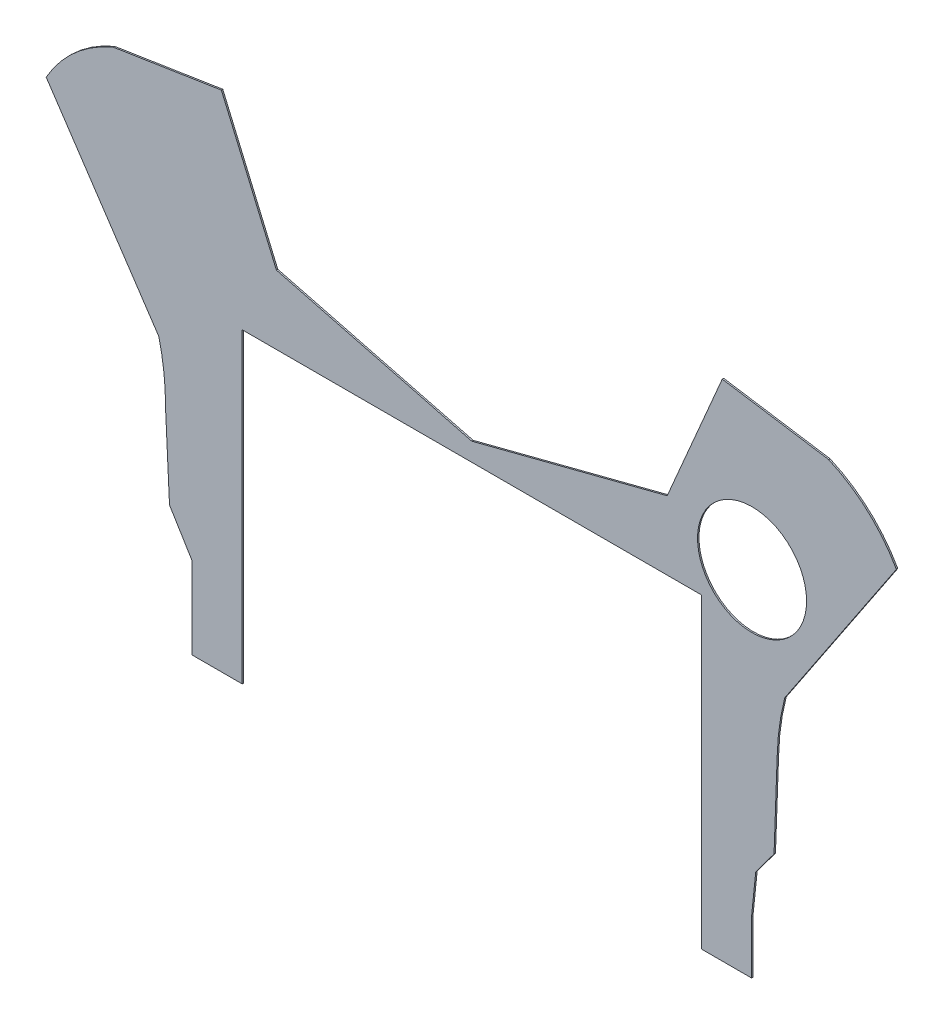
ISO-10303-21;
HEADER;
FILE_DESCRIPTION(('STEP AP214'),'2;1');
FILE_NAME('part.step','',(''),(''),'','','');
FILE_SCHEMA(('AUTOMOTIVE_DESIGN { 1 0 10303 214 1 1 1 1 }'));
ENDSEC;
DATA;
#1=APPLICATION_CONTEXT('core data for automotive mechanical design processes');
#2=APPLICATION_PROTOCOL_DEFINITION('international standard','automotive_design',2000,#1);
#3=PRODUCT_CONTEXT('',#1,'mechanical');
#4=PRODUCT('Part','Part','',(#3));
#5=PRODUCT_RELATED_PRODUCT_CATEGORY('part','',(#4));
#6=PRODUCT_DEFINITION_FORMATION('','',#4);
#7=PRODUCT_DEFINITION_CONTEXT('part definition',#1,'design');
#8=PRODUCT_DEFINITION('design','',#6,#7);
#9=PRODUCT_DEFINITION_SHAPE('','',#8);
#10=(LENGTH_UNIT() NAMED_UNIT(*) SI_UNIT(.MILLI.,.METRE.));
#11=(NAMED_UNIT(*) PLANE_ANGLE_UNIT() SI_UNIT($,.RADIAN.));
#12=(NAMED_UNIT(*) SI_UNIT($,.STERADIAN.) SOLID_ANGLE_UNIT());
#13=UNCERTAINTY_MEASURE_WITH_UNIT(LENGTH_MEASURE(1.E-05),#10,'distance_accuracy_value','');
#14=(GEOMETRIC_REPRESENTATION_CONTEXT(3) GLOBAL_UNCERTAINTY_ASSIGNED_CONTEXT((#13)) GLOBAL_UNIT_ASSIGNED_CONTEXT((#10,
#11,#12)) REPRESENTATION_CONTEXT('',''));
#15=CARTESIAN_POINT('',(0.,0.,0.));
#16=DIRECTION('',(0.,0.,1.));
#17=DIRECTION('',(1.,0.,0.));
#18=AXIS2_PLACEMENT_3D('',#15,#16,#17);
#19=CARTESIAN_POINT('',(72.2138054374449,15.665602419044,0.1));
#20=DIRECTION('',(0.,0.,1.));
#21=DIRECTION('',(1.,0.,0.));
#22=AXIS2_PLACEMENT_3D('',#19,#20,#21);
#23=PLANE('',#22);
#24=CARTESIAN_POINT('',(72.2138054374449,15.665602419044,0.1));
#25=DIRECTION('',(0.,0.,-1.));
#26=DIRECTION('',(1.,0.,0.));
#27=AXIS2_PLACEMENT_3D('',#24,#25,#26);
#28=CIRCLE('',#27,16.6592728359351);
#29=CARTESIAN_POINT('',(55.5594235199951,16.069253716389,0.1));
#30=VERTEX_POINT('',#29);
#31=CARTESIAN_POINT('',(56.0885640690144,19.8498541122362,0.1));
#32=VERTEX_POINT('',#31);
#33=EDGE_CURVE('E276',#30,#32,#28,.T.);
#34=ORIENTED_EDGE('',*,*,#33,.T.);
#35=DIRECTION('',(0.555533193274622,0.831494360275583,0.));
#36=VECTOR('',#35,1.);
#37=CARTESIAN_POINT('',(56.0885640690144,19.8498541122362,0.1));
#38=LINE('',#37,#36);
#39=CARTESIAN_POINT('',(63.8667249485025,31.4918171540619,0.1));
#40=VERTEX_POINT('',#39);
#41=EDGE_CURVE('E141',#32,#40,#38,.T.);
#42=ORIENTED_EDGE('',*,*,#41,.T.);
#43=CARTESIAN_POINT('',(55.1497676562329,26.5913421194611,0.1));
#44=DIRECTION('',(0.,0.,1.));
#45=DIRECTION('',(1.,0.,0.));
#46=AXIS2_PLACEMENT_3D('',#43,#44,#45);
#47=CIRCLE('',#46,9.99999999999992);
#48=CARTESIAN_POINT('',(59.1419674637845,35.7598938424205,0.1));
#49=VERTEX_POINT('',#48);
#50=EDGE_CURVE('E339',#40,#49,#47,.T.);
#51=ORIENTED_EDGE('',*,*,#50,.T.);
#52=DIRECTION('',(-0.988243061403979,0.15289097941635,0.));
#53=VECTOR('',#52,1.);
#54=CARTESIAN_POINT('',(59.1419674637845,35.7598938424205,0.1));
#55=LINE('',#54,#53);
#56=CARTESIAN_POINT('',(51.731314313622,36.9063952068051,0.1));
#57=VERTEX_POINT('',#56);
#58=EDGE_CURVE('E358',#49,#57,#55,.T.);
#59=ORIENTED_EDGE('',*,*,#58,.T.);
#60=DIRECTION('',(-0.393805994524143,-0.919193580632965,0.));
#61=VECTOR('',#60,1.);
#62=CARTESIAN_POINT('',(47.8937432112702,27.9490132178214,0.1));
#63=LINE('',#62,#61);
#64=CARTESIAN_POINT('',(47.8937432112702,27.9490132178214,0.1));
#65=VERTEX_POINT('',#64);
#66=EDGE_CURVE('E355',#57,#65,#63,.T.);
#67=ORIENTED_EDGE('',*,*,#66,.T.);
#68=DIRECTION('',(-0.968242480257776,-0.250012998510618,0.));
#69=VECTOR('',#68,1.);
#70=CARTESIAN_POINT('',(34.2721897594296,24.4317481811122,0.1));
#71=LINE('',#70,#69);
#72=CARTESIAN_POINT('',(34.2721897594296,24.4317481811122,0.1));
#73=VERTEX_POINT('',#72);
#74=EDGE_CURVE('E357',#65,#73,#71,.T.);
#75=ORIENTED_EDGE('',*,*,#74,.T.);
#76=DIRECTION('',(-0.968242480257776,0.250012998510619,0.));
#77=VECTOR('',#76,1.);
#78=CARTESIAN_POINT('',(20.650636307589,27.9490132178215,0.1));
#79=LINE('',#78,#77);
#80=CARTESIAN_POINT('',(20.650636307589,27.9490132178215,0.1));
#81=VERTEX_POINT('',#80);
#82=EDGE_CURVE('E360',#73,#81,#79,.T.);
#83=ORIENTED_EDGE('',*,*,#82,.T.);
#84=DIRECTION('',(-0.393805994524143,0.919193580632965,0.));
#85=VECTOR('',#84,1.);
#86=CARTESIAN_POINT('',(16.8168613198461,36.8975345895764,0.1));
#87=LINE('',#86,#85);
#88=CARTESIAN_POINT('',(16.8168613198461,36.8975345895764,0.1));
#89=VERTEX_POINT('',#88);
#90=EDGE_CURVE('E366',#81,#89,#87,.T.);
#91=ORIENTED_EDGE('',*,*,#90,.T.);
#92=DIRECTION('',(-0.988005256415205,-0.15442024898285,0.));
#93=VECTOR('',#92,1.);
#94=CARTESIAN_POINT('',(16.8168613198461,36.8975345895764,0.1));
#95=LINE('',#94,#93);
#96=CARTESIAN_POINT('',(9.29124173393465,35.7213181244728,0.1));
#97=VERTEX_POINT('',#96);
#98=EDGE_CURVE('E368',#89,#97,#95,.T.);
#99=ORIENTED_EDGE('',*,*,#98,.T.);
#100=CARTESIAN_POINT('',(12.9591684744056,26.8668878099787,0.1));
#101=DIRECTION('',(0.,0.,1.));
#102=DIRECTION('',(1.,0.,0.));
#103=AXIS2_PLACEMENT_3D('',#100,#101,#102);
#104=CIRCLE('',#103,9.58408173836664);
#105=CARTESIAN_POINT('',(4.60857288119245,31.5703095438128,0.1));
#106=VERTEX_POINT('',#105);
#107=EDGE_CURVE('E370',#97,#106,#104,.T.);
#108=ORIENTED_EDGE('',*,*,#107,.T.);
#109=DIRECTION('',(0.556348562845626,-0.830949021673175,0.));
#110=VECTOR('',#109,1.);
#111=CARTESIAN_POINT('',(12.4558154498448,19.8498541122363,0.1));
#112=LINE('',#111,#110);
#113=CARTESIAN_POINT('',(12.4558154498448,19.8498541122363,0.1));
#114=VERTEX_POINT('',#113);
#115=EDGE_CURVE('E372',#106,#114,#112,.T.);
#116=ORIENTED_EDGE('',*,*,#115,.T.);
#117=CARTESIAN_POINT('',(-3.33805679555692,15.9784958313329,0.1));
#118=DIRECTION('',(0.,0.,-1.));
#119=DIRECTION('',(1.,0.,0.));
#120=AXIS2_PLACEMENT_3D('',#117,#118,#119);
#121=CIRCLE('',#120,16.2614210769905);
#122=CARTESIAN_POINT('',(12.922946265494,15.8618986972154,0.1));
#123=VERTEX_POINT('',#122);
#124=EDGE_CURVE('E374',#114,#123,#121,.T.);
#125=ORIENTED_EDGE('',*,*,#124,.T.);
#126=DIRECTION('',(0.0481766333488553,-0.998838831843841,0.));
#127=VECTOR('',#126,1.);
#128=CARTESIAN_POINT('',(12.922946265494,15.8618986972154,0.1));
#129=LINE('',#128,#127);
#130=CARTESIAN_POINT('',(13.2035192514967,10.0448215354174,0.1));
#131=VERTEX_POINT('',#130);
#132=EDGE_CURVE('E376',#123,#131,#129,.T.);
#133=ORIENTED_EDGE('',*,*,#132,.T.);
#134=DIRECTION('',(0.521015191081465,-0.853547403875347,0.));
#135=VECTOR('',#134,1.);
#136=CARTESIAN_POINT('',(13.2035192514967,10.0448215354174,0.1));
#137=LINE('',#136,#135);
#138=CARTESIAN_POINT('',(14.7709323026018,7.47702435124306,0.1));
#139=VERTEX_POINT('',#138);
#140=EDGE_CURVE('E378',#131,#139,#137,.T.);
#141=ORIENTED_EDGE('',*,*,#140,.T.);
#142=DIRECTION('',(0.,-1.,0.));
#143=VECTOR('',#142,1.);
#144=CARTESIAN_POINT('',(14.7709323026018,7.47702435124306,0.1));
#145=LINE('',#144,#143);
#146=CARTESIAN_POINT('',(14.7709323026018,1.77702435124321,0.1));
#147=VERTEX_POINT('',#146);
#148=EDGE_CURVE('E380',#139,#147,#145,.T.);
#149=ORIENTED_EDGE('',*,*,#148,.T.);
#150=DIRECTION('',(1.,0.,0.));
#151=VECTOR('',#150,1.);
#152=CARTESIAN_POINT('',(14.7709323026018,1.77702435124321,0.1));
#153=LINE('',#152,#151);
#154=CARTESIAN_POINT('',(18.2721897594296,1.77702435124321,0.1));
#155=VERTEX_POINT('',#154);
#156=EDGE_CURVE('E382',#147,#155,#153,.T.);
#157=ORIENTED_EDGE('',*,*,#156,.T.);
#158=DIRECTION('',(0.,1.,0.));
#159=VECTOR('',#158,1.);
#160=CARTESIAN_POINT('',(18.2721897594296,1.77702435124321,0.1));
#161=LINE('',#160,#159);
#162=CARTESIAN_POINT('',(18.2721897594296,23.1550583682609,0.1));
#163=VERTEX_POINT('',#162);
#164=EDGE_CURVE('E384',#155,#163,#161,.T.);
#165=ORIENTED_EDGE('',*,*,#164,.T.);
#166=DIRECTION('',(1.,0.,0.));
#167=VECTOR('',#166,1.);
#168=CARTESIAN_POINT('',(18.2721897594296,23.1550583682609,0.1));
#169=LINE('',#168,#167);
#170=CARTESIAN_POINT('',(50.2721897594296,23.1550583682609,0.1));
#171=VERTEX_POINT('',#170);
#172=EDGE_CURVE('E386',#163,#171,#169,.T.);
#173=ORIENTED_EDGE('',*,*,#172,.T.);
#174=DIRECTION('',(0.,-1.,0.));
#175=VECTOR('',#174,1.);
#176=CARTESIAN_POINT('',(50.2721897594296,23.1550583682609,0.1));
#177=LINE('',#176,#175);
#178=CARTESIAN_POINT('',(50.2721897594296,1.77702435124324,0.1));
#179=VERTEX_POINT('',#178);
#180=EDGE_CURVE('E388',#171,#179,#177,.T.);
#181=ORIENTED_EDGE('',*,*,#180,.T.);
#182=DIRECTION('',(0.999999932845148,-0.000366482877309795,0.));
#183=VECTOR('',#182,1.);
#184=CARTESIAN_POINT('',(53.7709323026018,1.77574212192295,0.1));
#185=LINE('',#184,#183);
#186=CARTESIAN_POINT('',(53.7709323026018,1.77574212192295,0.1));
#187=VERTEX_POINT('',#186);
#188=EDGE_CURVE('E390',#179,#187,#185,.T.);
#189=ORIENTED_EDGE('',*,*,#188,.T.);
#190=DIRECTION('',(0.,1.,0.));
#191=VECTOR('',#190,1.);
#192=CARTESIAN_POINT('',(53.7709323026018,1.77574212192295,0.1));
#193=LINE('',#192,#191);
#194=CARTESIAN_POINT('',(53.7709323026018,5.47702435124322,0.1));
#195=VERTEX_POINT('',#194);
#196=EDGE_CURVE('E208',#187,#195,#193,.T.);
#197=ORIENTED_EDGE('',*,*,#196,.T.);
#198=DIRECTION('',(0.102692612712453,0.994713138193263,0.));
#199=VECTOR('',#198,1.);
#200=CARTESIAN_POINT('',(53.7709323026018,5.47702435124322,0.1));
#201=LINE('',#200,#199);
#202=CARTESIAN_POINT('',(54.0656414157022,8.33167006531321,0.1));
#203=VERTEX_POINT('',#202);
#204=EDGE_CURVE('E202',#195,#203,#201,.T.);
#205=ORIENTED_EDGE('',*,*,#204,.T.);
#206=DIRECTION('',(0.597105819847985,0.802162477247388,0.));
#207=VECTOR('',#206,1.);
#208=CARTESIAN_POINT('',(54.0656414157022,8.33167006531321,0.1));
#209=LINE('',#208,#207);
#210=CARTESIAN_POINT('',(55.3408602673625,10.0448215354175,0.1));
#211=VERTEX_POINT('',#210);
#212=EDGE_CURVE('E206',#203,#211,#209,.T.);
#213=ORIENTED_EDGE('',*,*,#212,.T.);
#214=DIRECTION('',(0.0362556256545215,0.999342548683083,0.));
#215=VECTOR('',#214,1.);
#216=CARTESIAN_POINT('',(55.3408602673625,10.0448215354175,0.1));
#217=LINE('',#216,#215);
#218=EDGE_CURVE('E50',#211,#30,#217,.T.);
#219=ORIENTED_EDGE('',*,*,#218,.T.);
#220=EDGE_LOOP('',(#34,#42,#51,#59,#67,#75,#83,#91,#99,#108,#116,#125,#133,#141,#149,#157,#165,
#173,#181,#189,#197,#205,#213,#219));
#221=FACE_BOUND('',#220,.T.);
#222=CARTESIAN_POINT('',(53.8088659007515,26.4413003423301,0.1));
#223=DIRECTION('',(0.,0.,1.));
#224=DIRECTION('',(1.,0.,0.));
#225=AXIS2_PLACEMENT_3D('',#222,#223,#224);
#226=CIRCLE('',#225,3.8007282860895);
#227=CARTESIAN_POINT('',(57.609594186841,26.4413003423301,0.1));
#228=VERTEX_POINT('',#227);
#229=EDGE_CURVE('E230',#228,#228,#226,.T.);
#230=ORIENTED_EDGE('',*,*,#229,.F.);
#231=EDGE_LOOP('',(#230));
#232=FACE_BOUND('',#231,.T.);
#233=ADVANCED_FACE('F33',(#221,#232),#23,.T.);
#234=CARTESIAN_POINT('',(72.2138054374449,15.665602419044,0.));
#235=DIRECTION('',(0.,0.,1.));
#236=DIRECTION('',(1.,0.,0.));
#237=AXIS2_PLACEMENT_3D('',#234,#235,#236);
#238=PLANE('',#237);
#239=CARTESIAN_POINT('',(72.2138054374449,15.665602419044,0.));
#240=DIRECTION('',(0.,0.,-1.));
#241=DIRECTION('',(1.,0.,0.));
#242=AXIS2_PLACEMENT_3D('',#239,#240,#241);
#243=CIRCLE('',#242,16.6592728359351);
#244=CARTESIAN_POINT('',(55.5594235199951,16.069253716389,0.));
#245=VERTEX_POINT('',#244);
#246=CARTESIAN_POINT('',(56.0885640690144,19.8498541122362,0.));
#247=VERTEX_POINT('',#246);
#248=EDGE_CURVE('E226',#245,#247,#243,.T.);
#249=ORIENTED_EDGE('',*,*,#248,.F.);
#250=DIRECTION('',(0.0362556256545215,0.999342548683083,0.));
#251=VECTOR('',#250,1.);
#252=CARTESIAN_POINT('',(55.3408602673625,10.0448215354175,0.));
#253=LINE('',#252,#251);
#254=CARTESIAN_POINT('',(55.3408602673625,10.0448215354175,0.));
#255=VERTEX_POINT('',#254);
#256=EDGE_CURVE('E133',#255,#245,#253,.T.);
#257=ORIENTED_EDGE('',*,*,#256,.F.);
#258=DIRECTION('',(0.597105819847985,0.802162477247388,0.));
#259=VECTOR('',#258,1.);
#260=CARTESIAN_POINT('',(54.0656414157022,8.33167006531321,0.));
#261=LINE('',#260,#259);
#262=CARTESIAN_POINT('',(54.0656414157022,8.33167006531321,0.));
#263=VERTEX_POINT('',#262);
#264=EDGE_CURVE('E127',#263,#255,#261,.T.);
#265=ORIENTED_EDGE('',*,*,#264,.F.);
#266=DIRECTION('',(0.102692612712453,0.994713138193263,0.));
#267=VECTOR('',#266,1.);
#268=CARTESIAN_POINT('',(53.7709323026018,5.47702435124322,0.));
#269=LINE('',#268,#267);
#270=CARTESIAN_POINT('',(53.7709323026018,5.47702435124322,0.));
#271=VERTEX_POINT('',#270);
#272=EDGE_CURVE('E216',#271,#263,#269,.T.);
#273=ORIENTED_EDGE('',*,*,#272,.F.);
#274=DIRECTION('',(0.,1.,0.));
#275=VECTOR('',#274,1.);
#276=CARTESIAN_POINT('',(53.7709323026018,1.77574212192295,0.));
#277=LINE('',#276,#275);
#278=CARTESIAN_POINT('',(53.7709323026018,1.77574212192295,0.));
#279=VERTEX_POINT('',#278);
#280=EDGE_CURVE('E271',#279,#271,#277,.T.);
#281=ORIENTED_EDGE('',*,*,#280,.F.);
#282=DIRECTION('',(0.999999932845148,-0.000366482877309795,0.));
#283=VECTOR('',#282,1.);
#284=CARTESIAN_POINT('',(53.7709323026018,1.77574212192295,0.));
#285=LINE('',#284,#283);
#286=CARTESIAN_POINT('',(50.2721897594296,1.77702435124324,0.));
#287=VERTEX_POINT('',#286);
#288=EDGE_CURVE('E269',#287,#279,#285,.T.);
#289=ORIENTED_EDGE('',*,*,#288,.F.);
#290=DIRECTION('',(0.,-1.,0.));
#291=VECTOR('',#290,1.);
#292=CARTESIAN_POINT('',(50.2721897594296,23.1550583682609,0.));
#293=LINE('',#292,#291);
#294=CARTESIAN_POINT('',(50.2721897594296,23.1550583682609,0.));
#295=VERTEX_POINT('',#294);
#296=EDGE_CURVE('E267',#295,#287,#293,.T.);
#297=ORIENTED_EDGE('',*,*,#296,.F.);
#298=DIRECTION('',(1.,0.,0.));
#299=VECTOR('',#298,1.);
#300=CARTESIAN_POINT('',(34.7721897594296,23.1550583682609,0.));
#301=LINE('',#300,#299);
#302=CARTESIAN_POINT('',(18.2721897594296,23.1550583682609,0.));
#303=VERTEX_POINT('',#302);
#304=EDGE_CURVE('E265',#303,#295,#301,.T.);
#305=ORIENTED_EDGE('',*,*,#304,.F.);
#306=DIRECTION('',(0.,1.,0.));
#307=VECTOR('',#306,1.);
#308=CARTESIAN_POINT('',(18.2721897594296,1.77702435124321,0.));
#309=LINE('',#308,#307);
#310=CARTESIAN_POINT('',(18.2721897594296,1.77702435124321,0.));
#311=VERTEX_POINT('',#310);
#312=EDGE_CURVE('E262',#311,#303,#309,.T.);
#313=ORIENTED_EDGE('',*,*,#312,.F.);
#314=DIRECTION('',(1.,0.,0.));
#315=VECTOR('',#314,1.);
#316=CARTESIAN_POINT('',(14.7709323026018,1.77702435124321,0.));
#317=LINE('',#316,#315);
#318=CARTESIAN_POINT('',(14.7709323026018,1.77702435124321,0.));
#319=VERTEX_POINT('',#318);
#320=EDGE_CURVE('E260',#319,#311,#317,.T.);
#321=ORIENTED_EDGE('',*,*,#320,.F.);
#322=DIRECTION('',(0.,-1.,0.));
#323=VECTOR('',#322,1.);
#324=CARTESIAN_POINT('',(14.7709323026018,4.47702435124306,0.));
#325=LINE('',#324,#323);
#326=CARTESIAN_POINT('',(14.7709323026018,7.47702435124306,0.));
#327=VERTEX_POINT('',#326);
#328=EDGE_CURVE('E258',#327,#319,#325,.T.);
#329=ORIENTED_EDGE('',*,*,#328,.F.);
#330=DIRECTION('',(0.521015191081465,-0.853547403875347,0.));
#331=VECTOR('',#330,1.);
#332=CARTESIAN_POINT('',(13.2035192514967,10.0448215354174,0.));
#333=LINE('',#332,#331);
#334=CARTESIAN_POINT('',(13.2035192514967,10.0448215354174,0.));
#335=VERTEX_POINT('',#334);
#336=EDGE_CURVE('E255',#335,#327,#333,.T.);
#337=ORIENTED_EDGE('',*,*,#336,.F.);
#338=DIRECTION('',(0.0481766333488553,-0.998838831843841,0.));
#339=VECTOR('',#338,1.);
#340=CARTESIAN_POINT('',(12.922946265494,15.8618986972154,0.));
#341=LINE('',#340,#339);
#342=CARTESIAN_POINT('',(12.922946265494,15.8618986972154,0.));
#343=VERTEX_POINT('',#342);
#344=EDGE_CURVE('E253',#343,#335,#341,.T.);
#345=ORIENTED_EDGE('',*,*,#344,.F.);
#346=CARTESIAN_POINT('',(-3.33805679555692,15.9784958313329,0.));
#347=DIRECTION('',(0.,0.,-1.));
#348=DIRECTION('',(1.,0.,0.));
#349=AXIS2_PLACEMENT_3D('',#346,#347,#348);
#350=CIRCLE('',#349,16.2614210769905);
#351=CARTESIAN_POINT('',(12.4558154498448,19.8498541122363,0.));
#352=VERTEX_POINT('',#351);
#353=EDGE_CURVE('E251',#352,#343,#350,.T.);
#354=ORIENTED_EDGE('',*,*,#353,.F.);
#355=DIRECTION('',(0.556348562845626,-0.830949021673175,0.));
#356=VECTOR('',#355,1.);
#357=CARTESIAN_POINT('',(12.4558154498448,19.8498541122363,0.));
#358=LINE('',#357,#356);
#359=CARTESIAN_POINT('',(4.60857288119245,31.5703095438128,0.));
#360=VERTEX_POINT('',#359);
#361=EDGE_CURVE('E249',#360,#352,#358,.T.);
#362=ORIENTED_EDGE('',*,*,#361,.F.);
#363=CARTESIAN_POINT('',(12.9591684744056,26.8668878099787,0.));
#364=DIRECTION('',(0.,0.,1.));
#365=DIRECTION('',(1.,0.,0.));
#366=AXIS2_PLACEMENT_3D('',#363,#364,#365);
#367=CIRCLE('',#366,9.58408173836664);
#368=CARTESIAN_POINT('',(9.29124173393465,35.7213181244728,0.));
#369=VERTEX_POINT('',#368);
#370=EDGE_CURVE('E247',#369,#360,#367,.T.);
#371=ORIENTED_EDGE('',*,*,#370,.F.);
#372=DIRECTION('',(-0.98800525641528,-0.154420248982368,0.));
#373=VECTOR('',#372,1.);
#374=CARTESIAN_POINT('',(9.77855410606377,35.7974825956107,0.));
#375=LINE('',#374,#373);
#376=CARTESIAN_POINT('',(16.8168613198461,36.8975345895764,0.));
#377=VERTEX_POINT('',#376);
#378=EDGE_CURVE('E245',#377,#369,#375,.T.);
#379=ORIENTED_EDGE('',*,*,#378,.F.);
#380=DIRECTION('',(-0.393805994524143,0.919193580632965,0.));
#381=VECTOR('',#380,1.);
#382=CARTESIAN_POINT('',(16.8168613198461,36.8975345895764,0.));
#383=LINE('',#382,#381);
#384=CARTESIAN_POINT('',(20.650636307589,27.9490132178215,0.));
#385=VERTEX_POINT('',#384);
#386=EDGE_CURVE('E242',#385,#377,#383,.T.);
#387=ORIENTED_EDGE('',*,*,#386,.F.);
#388=DIRECTION('',(-0.968242480257776,0.250012998510619,0.));
#389=VECTOR('',#388,1.);
#390=CARTESIAN_POINT('',(20.650636307589,27.9490132178215,0.));
#391=LINE('',#390,#389);
#392=CARTESIAN_POINT('',(34.2721897594296,24.4317481811122,0.));
#393=VERTEX_POINT('',#392);
#394=EDGE_CURVE('E240',#393,#385,#391,.T.);
#395=ORIENTED_EDGE('',*,*,#394,.F.);
#396=DIRECTION('',(-0.968242480257776,-0.250012998510618,0.));
#397=VECTOR('',#396,1.);
#398=CARTESIAN_POINT('',(34.2721897594296,24.4317481811122,0.));
#399=LINE('',#398,#397);
#400=CARTESIAN_POINT('',(47.8937432112702,27.9490132178214,0.));
#401=VERTEX_POINT('',#400);
#402=EDGE_CURVE('E238',#401,#393,#399,.T.);
#403=ORIENTED_EDGE('',*,*,#402,.F.);
#404=DIRECTION('',(-0.393805994524143,-0.919193580632965,0.));
#405=VECTOR('',#404,1.);
#406=CARTESIAN_POINT('',(47.8937432112702,27.9490132178214,0.));
#407=LINE('',#406,#405);
#408=CARTESIAN_POINT('',(51.731314313622,36.9063952068051,0.));
#409=VERTEX_POINT('',#408);
#410=EDGE_CURVE('E236',#409,#401,#407,.T.);
#411=ORIENTED_EDGE('',*,*,#410,.F.);
#412=DIRECTION('',(-0.988243061403979,0.15289097941635,0.));
#413=VECTOR('',#412,1.);
#414=CARTESIAN_POINT('',(59.1419674637845,35.7598938424205,0.));
#415=LINE('',#414,#413);
#416=CARTESIAN_POINT('',(59.1419674637845,35.7598938424205,0.));
#417=VERTEX_POINT('',#416);
#418=EDGE_CURVE('E234',#417,#409,#415,.T.);
#419=ORIENTED_EDGE('',*,*,#418,.F.);
#420=CARTESIAN_POINT('',(55.1497676562329,26.5913421194611,0.));
#421=DIRECTION('',(0.,0.,1.));
#422=DIRECTION('',(1.,0.,0.));
#423=AXIS2_PLACEMENT_3D('',#420,#421,#422);
#424=CIRCLE('',#423,9.99999999999992);
#425=CARTESIAN_POINT('',(63.8667249485025,31.4918171540619,0.));
#426=VERTEX_POINT('',#425);
#427=EDGE_CURVE('E232',#426,#417,#424,.T.);
#428=ORIENTED_EDGE('',*,*,#427,.F.);
#429=DIRECTION('',(0.555533193274622,0.831494360275583,0.));
#430=VECTOR('',#429,1.);
#431=CARTESIAN_POINT('',(56.0885640690144,19.8498541122362,0.));
#432=LINE('',#431,#430);
#433=EDGE_CURVE('E229',#247,#426,#432,.T.);
#434=ORIENTED_EDGE('',*,*,#433,.F.);
#435=EDGE_LOOP('',(#249,#257,#265,#273,#281,#289,#297,#305,#313,#321,#329,#337,#345,#354,#362,
#371,#379,#387,#395,#403,#411,#419,#428,#434));
#436=FACE_BOUND('',#435,.T.);
#437=CARTESIAN_POINT('',(53.8088659007515,26.4413003423301,0.));
#438=DIRECTION('',(0.,0.,1.));
#439=DIRECTION('',(1.,0.,0.));
#440=AXIS2_PLACEMENT_3D('',#437,#438,#439);
#441=CIRCLE('',#440,3.8007282860895);
#442=CARTESIAN_POINT('',(57.609594186841,26.4413003423301,0.));
#443=VERTEX_POINT('',#442);
#444=EDGE_CURVE('E705',#443,#443,#441,.T.);
#445=ORIENTED_EDGE('',*,*,#444,.T.);
#446=EDGE_LOOP('',(#445));
#447=FACE_BOUND('',#446,.T.);
#448=ADVANCED_FACE('F343',(#436,#447),#238,.F.);
#449=CARTESIAN_POINT('',(72.2138054374449,15.665602419044,0.1));
#450=DIRECTION('',(0.,0.,-1.));
#451=DIRECTION('',(-1.,0.,0.));
#452=AXIS2_PLACEMENT_3D('',#449,#450,#451);
#453=CYLINDRICAL_SURFACE('',#452,16.6592728359351);
#454=ORIENTED_EDGE('',*,*,#248,.T.);
#455=DIRECTION('',(0.,0.,-1.));
#456=VECTOR('',#455,1.);
#457=CARTESIAN_POINT('',(56.0885640690144,19.8498541122362,0.1));
#458=LINE('',#457,#456);
#459=EDGE_CURVE('E11',#32,#247,#458,.T.);
#460=ORIENTED_EDGE('',*,*,#459,.F.);
#461=ORIENTED_EDGE('',*,*,#33,.F.);
#462=DIRECTION('',(0.,0.,-1.));
#463=VECTOR('',#462,1.);
#464=CARTESIAN_POINT('',(55.5594235199951,16.069253716389,0.1));
#465=LINE('',#464,#463);
#466=EDGE_CURVE('E222',#30,#245,#465,.T.);
#467=ORIENTED_EDGE('',*,*,#466,.T.);
#468=EDGE_LOOP('',(#454,#460,#461,#467));
#469=FACE_BOUND('',#468,.T.);
#470=ADVANCED_FACE('F35',(#469),#453,.F.);
#471=CARTESIAN_POINT('',(56.0885640690144,19.8498541122362,0.1));
#472=DIRECTION('',(-0.831494360275583,0.555533193274622,0.));
#473=DIRECTION('',(-0.555533193274622,-0.831494360275583,0.));
#474=AXIS2_PLACEMENT_3D('',#471,#472,#473);
#475=PLANE('',#474);
#476=ORIENTED_EDGE('',*,*,#433,.T.);
#477=DIRECTION('',(0.,0.,-1.));
#478=VECTOR('',#477,1.);
#479=CARTESIAN_POINT('',(63.8667249485025,31.4918171540619,0.1));
#480=LINE('',#479,#478);
#481=EDGE_CURVE('E42',#40,#426,#480,.T.);
#482=ORIENTED_EDGE('',*,*,#481,.F.);
#483=ORIENTED_EDGE('',*,*,#41,.F.);
#484=ORIENTED_EDGE('',*,*,#459,.T.);
#485=EDGE_LOOP('',(#476,#482,#483,#484));
#486=FACE_BOUND('',#485,.T.);
#487=ADVANCED_FACE('F424',(#486),#475,.F.);
#488=CARTESIAN_POINT('',(55.1497676562329,26.5913421194611,0.1));
#489=DIRECTION('',(0.,0.,-1.));
#490=DIRECTION('',(-1.,0.,0.));
#491=AXIS2_PLACEMENT_3D('',#488,#489,#490);
#492=CYLINDRICAL_SURFACE('',#491,9.99999999999992);
#493=ORIENTED_EDGE('',*,*,#427,.T.);
#494=DIRECTION('',(0.,0.,-1.));
#495=VECTOR('',#494,1.);
#496=CARTESIAN_POINT('',(59.1419674637845,35.7598938424205,0.1));
#497=LINE('',#496,#495);
#498=EDGE_CURVE('E331',#49,#417,#497,.T.);
#499=ORIENTED_EDGE('',*,*,#498,.F.);
#500=ORIENTED_EDGE('',*,*,#50,.F.);
#501=ORIENTED_EDGE('',*,*,#481,.T.);
#502=EDGE_LOOP('',(#493,#499,#500,#501));
#503=FACE_BOUND('',#502,.T.);
#504=ADVANCED_FACE('F337',(#503),#492,.T.);
#505=CARTESIAN_POINT('',(59.1419674637845,35.7598938424205,0.1));
#506=DIRECTION('',(-0.15289097941635,-0.988243061403979,0.));
#507=DIRECTION('',(0.988243061403979,-0.15289097941635,0.));
#508=AXIS2_PLACEMENT_3D('',#505,#506,#507);
#509=PLANE('',#508);
#510=ORIENTED_EDGE('',*,*,#418,.T.);
#511=DIRECTION('',(0.,0.,-1.));
#512=VECTOR('',#511,1.);
#513=CARTESIAN_POINT('',(51.731314313622,36.9063952068051,0.1));
#514=LINE('',#513,#512);
#515=EDGE_CURVE('E328',#57,#409,#514,.T.);
#516=ORIENTED_EDGE('',*,*,#515,.F.);
#517=ORIENTED_EDGE('',*,*,#58,.F.);
#518=ORIENTED_EDGE('',*,*,#498,.T.);
#519=EDGE_LOOP('',(#510,#516,#517,#518));
#520=FACE_BOUND('',#519,.T.);
#521=ADVANCED_FACE('F349',(#520),#509,.F.);
#522=CARTESIAN_POINT('',(47.8937432112702,27.9490132178214,0.1));
#523=DIRECTION('',(0.919193580632965,-0.393805994524143,0.));
#524=DIRECTION('',(0.393805994524143,0.919193580632965,0.));
#525=AXIS2_PLACEMENT_3D('',#522,#523,#524);
#526=PLANE('',#525);
#527=ORIENTED_EDGE('',*,*,#410,.T.);
#528=DIRECTION('',(0.,0.,-1.));
#529=VECTOR('',#528,1.);
#530=CARTESIAN_POINT('',(47.8937432112702,27.9490132178214,0.1));
#531=LINE('',#530,#529);
#532=EDGE_CURVE('E325',#65,#401,#531,.T.);
#533=ORIENTED_EDGE('',*,*,#532,.F.);
#534=ORIENTED_EDGE('',*,*,#66,.F.);
#535=ORIENTED_EDGE('',*,*,#515,.T.);
#536=EDGE_LOOP('',(#527,#533,#534,#535));
#537=FACE_BOUND('',#536,.T.);
#538=ADVANCED_FACE('F353',(#537),#526,.F.);
#539=CARTESIAN_POINT('',(34.2721897594296,24.4317481811122,0.1));
#540=DIRECTION('',(0.250012998510618,-0.968242480257776,0.));
#541=DIRECTION('',(0.968242480257776,0.250012998510618,0.));
#542=AXIS2_PLACEMENT_3D('',#539,#540,#541);
#543=PLANE('',#542);
#544=ORIENTED_EDGE('',*,*,#402,.T.);
#545=DIRECTION('',(0.,0.,-1.));
#546=VECTOR('',#545,1.);
#547=CARTESIAN_POINT('',(34.2721897594296,24.4317481811122,0.1));
#548=LINE('',#547,#546);
#549=EDGE_CURVE('E322',#73,#393,#548,.T.);
#550=ORIENTED_EDGE('',*,*,#549,.F.);
#551=ORIENTED_EDGE('',*,*,#74,.F.);
#552=ORIENTED_EDGE('',*,*,#532,.T.);
#553=EDGE_LOOP('',(#544,#550,#551,#552));
#554=FACE_BOUND('',#553,.T.);
#555=ADVANCED_FACE('F437',(#554),#543,.F.);
#556=CARTESIAN_POINT('',(20.650636307589,27.9490132178215,0.1));
#557=DIRECTION('',(-0.250012998510619,-0.968242480257776,0.));
#558=DIRECTION('',(0.968242480257776,-0.250012998510619,0.));
#559=AXIS2_PLACEMENT_3D('',#556,#557,#558);
#560=PLANE('',#559);
#561=ORIENTED_EDGE('',*,*,#394,.T.);
#562=DIRECTION('',(0.,0.,-1.));
#563=VECTOR('',#562,1.);
#564=CARTESIAN_POINT('',(20.650636307589,27.9490132178215,0.1));
#565=LINE('',#564,#563);
#566=EDGE_CURVE('E319',#81,#385,#565,.T.);
#567=ORIENTED_EDGE('',*,*,#566,.F.);
#568=ORIENTED_EDGE('',*,*,#82,.F.);
#569=ORIENTED_EDGE('',*,*,#549,.T.);
#570=EDGE_LOOP('',(#561,#567,#568,#569));
#571=FACE_BOUND('',#570,.T.);
#572=ADVANCED_FACE('F440',(#571),#560,.F.);
#573=CARTESIAN_POINT('',(16.8168613198461,36.8975345895764,0.1));
#574=DIRECTION('',(-0.919193580632965,-0.393805994524143,0.));
#575=DIRECTION('',(0.393805994524143,-0.919193580632965,0.));
#576=AXIS2_PLACEMENT_3D('',#573,#574,#575);
#577=PLANE('',#576);
#578=ORIENTED_EDGE('',*,*,#386,.T.);
#579=DIRECTION('',(0.,0.,-1.));
#580=VECTOR('',#579,1.);
#581=CARTESIAN_POINT('',(16.8168613198461,36.8975345895764,0.1));
#582=LINE('',#581,#580);
#583=EDGE_CURVE('E316',#89,#377,#582,.T.);
#584=ORIENTED_EDGE('',*,*,#583,.F.);
#585=ORIENTED_EDGE('',*,*,#90,.F.);
#586=ORIENTED_EDGE('',*,*,#566,.T.);
#587=EDGE_LOOP('',(#578,#584,#585,#586));
#588=FACE_BOUND('',#587,.T.);
#589=ADVANCED_FACE('F444',(#588),#577,.F.);
#590=CARTESIAN_POINT('',(9.77855410606377,35.7974825956107,0.1));
#591=DIRECTION('',(0.154420248982368,-0.98800525641528,0.));
#592=DIRECTION('',(0.98800525641528,0.154420248982368,0.));
#593=AXIS2_PLACEMENT_3D('',#590,#591,#592);
#594=PLANE('',#593);
#595=ORIENTED_EDGE('',*,*,#378,.T.);
#596=DIRECTION('',(0.,0.,-1.));
#597=VECTOR('',#596,1.);
#598=CARTESIAN_POINT('',(9.29124173393465,35.7213181244728,0.1));
#599=LINE('',#598,#597);
#600=EDGE_CURVE('E313',#97,#369,#599,.T.);
#601=ORIENTED_EDGE('',*,*,#600,.F.);
#602=ORIENTED_EDGE('',*,*,#98,.F.);
#603=ORIENTED_EDGE('',*,*,#583,.T.);
#604=EDGE_LOOP('',(#595,#601,#602,#603));
#605=FACE_BOUND('',#604,.T.);
#606=ADVANCED_FACE('F448',(#605),#594,.F.);
#607=CARTESIAN_POINT('',(12.9591684744056,26.8668878099787,0.1));
#608=DIRECTION('',(0.,0.,-1.));
#609=DIRECTION('',(-1.,0.,0.));
#610=AXIS2_PLACEMENT_3D('',#607,#608,#609);
#611=CYLINDRICAL_SURFACE('',#610,9.58408173836664);
#612=ORIENTED_EDGE('',*,*,#370,.T.);
#613=DIRECTION('',(0.,0.,-1.));
#614=VECTOR('',#613,1.);
#615=CARTESIAN_POINT('',(4.60857288119245,31.5703095438128,0.1));
#616=LINE('',#615,#614);
#617=EDGE_CURVE('E310',#106,#360,#616,.T.);
#618=ORIENTED_EDGE('',*,*,#617,.F.);
#619=ORIENTED_EDGE('',*,*,#107,.F.);
#620=ORIENTED_EDGE('',*,*,#600,.T.);
#621=EDGE_LOOP('',(#612,#618,#619,#620));
#622=FACE_BOUND('',#621,.T.);
#623=ADVANCED_FACE('F452',(#622),#611,.T.);
#624=CARTESIAN_POINT('',(12.4558154498448,19.8498541122363,0.1));
#625=DIRECTION('',(0.830949021673175,0.556348562845626,0.));
#626=DIRECTION('',(-0.556348562845626,0.830949021673175,0.));
#627=AXIS2_PLACEMENT_3D('',#624,#625,#626);
#628=PLANE('',#627);
#629=ORIENTED_EDGE('',*,*,#361,.T.);
#630=DIRECTION('',(0.,0.,-1.));
#631=VECTOR('',#630,1.);
#632=CARTESIAN_POINT('',(12.4558154498448,19.8498541122363,0.1));
#633=LINE('',#632,#631);
#634=EDGE_CURVE('E307',#114,#352,#633,.T.);
#635=ORIENTED_EDGE('',*,*,#634,.F.);
#636=ORIENTED_EDGE('',*,*,#115,.F.);
#637=ORIENTED_EDGE('',*,*,#617,.T.);
#638=EDGE_LOOP('',(#629,#635,#636,#637));
#639=FACE_BOUND('',#638,.T.);
#640=ADVANCED_FACE('F456',(#639),#628,.F.);
#641=CARTESIAN_POINT('',(-3.33805679555692,15.9784958313329,0.1));
#642=DIRECTION('',(0.,0.,-1.));
#643=DIRECTION('',(-1.,0.,0.));
#644=AXIS2_PLACEMENT_3D('',#641,#642,#643);
#645=CYLINDRICAL_SURFACE('',#644,16.2614210769905);
#646=ORIENTED_EDGE('',*,*,#353,.T.);
#647=DIRECTION('',(0.,0.,-1.));
#648=VECTOR('',#647,1.);
#649=CARTESIAN_POINT('',(12.922946265494,15.8618986972154,0.1));
#650=LINE('',#649,#648);
#651=EDGE_CURVE('E304',#123,#343,#650,.T.);
#652=ORIENTED_EDGE('',*,*,#651,.F.);
#653=ORIENTED_EDGE('',*,*,#124,.F.);
#654=ORIENTED_EDGE('',*,*,#634,.T.);
#655=EDGE_LOOP('',(#646,#652,#653,#654));
#656=FACE_BOUND('',#655,.T.);
#657=ADVANCED_FACE('F460',(#656),#645,.F.);
#658=CARTESIAN_POINT('',(12.922946265494,15.8618986972154,0.1));
#659=DIRECTION('',(0.998838831843841,0.0481766333488553,0.));
#660=DIRECTION('',(-0.0481766333488553,0.998838831843842,0.));
#661=AXIS2_PLACEMENT_3D('',#658,#659,#660);
#662=PLANE('',#661);
#663=ORIENTED_EDGE('',*,*,#344,.T.);
#664=DIRECTION('',(0.,0.,-1.));
#665=VECTOR('',#664,1.);
#666=CARTESIAN_POINT('',(13.2035192514967,10.0448215354174,0.1));
#667=LINE('',#666,#665);
#668=EDGE_CURVE('E301',#131,#335,#667,.T.);
#669=ORIENTED_EDGE('',*,*,#668,.F.);
#670=ORIENTED_EDGE('',*,*,#132,.F.);
#671=ORIENTED_EDGE('',*,*,#651,.T.);
#672=EDGE_LOOP('',(#663,#669,#670,#671));
#673=FACE_BOUND('',#672,.T.);
#674=ADVANCED_FACE('F464',(#673),#662,.F.);
#675=CARTESIAN_POINT('',(13.2035192514967,10.0448215354174,0.1));
#676=DIRECTION('',(0.853547403875347,0.521015191081465,0.));
#677=DIRECTION('',(-0.521015191081465,0.853547403875347,0.));
#678=AXIS2_PLACEMENT_3D('',#675,#676,#677);
#679=PLANE('',#678);
#680=ORIENTED_EDGE('',*,*,#336,.T.);
#681=DIRECTION('',(0.,0.,-1.));
#682=VECTOR('',#681,1.);
#683=CARTESIAN_POINT('',(14.7709323026018,7.47702435124306,0.1));
#684=LINE('',#683,#682);
#685=EDGE_CURVE('E298',#139,#327,#684,.T.);
#686=ORIENTED_EDGE('',*,*,#685,.F.);
#687=ORIENTED_EDGE('',*,*,#140,.F.);
#688=ORIENTED_EDGE('',*,*,#668,.T.);
#689=EDGE_LOOP('',(#680,#686,#687,#688));
#690=FACE_BOUND('',#689,.T.);
#691=ADVANCED_FACE('F468',(#690),#679,.F.);
#692=CARTESIAN_POINT('',(14.7709323026018,4.47702435124306,0.1));
#693=DIRECTION('',(1.,0.,0.));
#694=DIRECTION('',(0.,0.,-1.));
#695=AXIS2_PLACEMENT_3D('',#692,#693,#694);
#696=PLANE('',#695);
#697=ORIENTED_EDGE('',*,*,#328,.T.);
#698=DIRECTION('',(0.,0.,-1.));
#699=VECTOR('',#698,1.);
#700=CARTESIAN_POINT('',(14.7709323026018,1.77702435124321,0.1));
#701=LINE('',#700,#699);
#702=EDGE_CURVE('E295',#147,#319,#701,.T.);
#703=ORIENTED_EDGE('',*,*,#702,.F.);
#704=ORIENTED_EDGE('',*,*,#148,.F.);
#705=ORIENTED_EDGE('',*,*,#685,.T.);
#706=EDGE_LOOP('',(#697,#703,#704,#705));
#707=FACE_BOUND('',#706,.T.);
#708=ADVANCED_FACE('F472',(#707),#696,.F.);
#709=CARTESIAN_POINT('',(14.7709323026018,1.77702435124321,0.1));
#710=DIRECTION('',(0.,1.,0.));
#711=DIRECTION('',(0.,0.,1.));
#712=AXIS2_PLACEMENT_3D('',#709,#710,#711);
#713=PLANE('',#712);
#714=ORIENTED_EDGE('',*,*,#320,.T.);
#715=DIRECTION('',(0.,0.,-1.));
#716=VECTOR('',#715,1.);
#717=CARTESIAN_POINT('',(18.2721897594296,1.77702435124321,0.1));
#718=LINE('',#717,#716);
#719=EDGE_CURVE('E292',#155,#311,#718,.T.);
#720=ORIENTED_EDGE('',*,*,#719,.F.);
#721=ORIENTED_EDGE('',*,*,#156,.F.);
#722=ORIENTED_EDGE('',*,*,#702,.T.);
#723=EDGE_LOOP('',(#714,#720,#721,#722));
#724=FACE_BOUND('',#723,.T.);
#725=ADVANCED_FACE('F476',(#724),#713,.F.);
#726=CARTESIAN_POINT('',(18.2721897594296,1.77702435124321,0.1));
#727=DIRECTION('',(-1.,0.,0.));
#728=DIRECTION('',(0.,-1.,0.));
#729=AXIS2_PLACEMENT_3D('',#726,#727,#728);
#730=PLANE('',#729);
#731=ORIENTED_EDGE('',*,*,#312,.T.);
#732=DIRECTION('',(0.,0.,-1.));
#733=VECTOR('',#732,1.);
#734=CARTESIAN_POINT('',(18.2721897594296,23.1550583682609,0.1));
#735=LINE('',#734,#733);
#736=EDGE_CURVE('E289',#163,#303,#735,.T.);
#737=ORIENTED_EDGE('',*,*,#736,.F.);
#738=ORIENTED_EDGE('',*,*,#164,.F.);
#739=ORIENTED_EDGE('',*,*,#719,.T.);
#740=EDGE_LOOP('',(#731,#737,#738,#739));
#741=FACE_BOUND('',#740,.T.);
#742=ADVANCED_FACE('F480',(#741),#730,.F.);
#743=CARTESIAN_POINT('',(34.7721897594296,23.1550583682609,0.1));
#744=DIRECTION('',(0.,1.,0.));
#745=DIRECTION('',(0.,0.,1.));
#746=AXIS2_PLACEMENT_3D('',#743,#744,#745);
#747=PLANE('',#746);
#748=ORIENTED_EDGE('',*,*,#304,.T.);
#749=DIRECTION('',(0.,0.,-1.));
#750=VECTOR('',#749,1.);
#751=CARTESIAN_POINT('',(50.2721897594296,23.1550583682609,0.1));
#752=LINE('',#751,#750);
#753=EDGE_CURVE('E286',#171,#295,#752,.T.);
#754=ORIENTED_EDGE('',*,*,#753,.F.);
#755=ORIENTED_EDGE('',*,*,#172,.F.);
#756=ORIENTED_EDGE('',*,*,#736,.T.);
#757=EDGE_LOOP('',(#748,#754,#755,#756));
#758=FACE_BOUND('',#757,.T.);
#759=ADVANCED_FACE('F484',(#758),#747,.F.);
#760=CARTESIAN_POINT('',(50.2721897594296,23.1550583682609,0.1));
#761=DIRECTION('',(1.,0.,0.));
#762=DIRECTION('',(0.,1.,0.));
#763=AXIS2_PLACEMENT_3D('',#760,#761,#762);
#764=PLANE('',#763);
#765=ORIENTED_EDGE('',*,*,#296,.T.);
#766=DIRECTION('',(0.,0.,-1.));
#767=VECTOR('',#766,1.);
#768=CARTESIAN_POINT('',(50.2721897594296,1.77702435124324,0.1));
#769=LINE('',#768,#767);
#770=EDGE_CURVE('E283',#179,#287,#769,.T.);
#771=ORIENTED_EDGE('',*,*,#770,.F.);
#772=ORIENTED_EDGE('',*,*,#180,.F.);
#773=ORIENTED_EDGE('',*,*,#753,.T.);
#774=EDGE_LOOP('',(#765,#771,#772,#773));
#775=FACE_BOUND('',#774,.T.);
#776=ADVANCED_FACE('F488',(#775),#764,.F.);
#777=CARTESIAN_POINT('',(53.7709323026018,1.77574212192295,0.1));
#778=DIRECTION('',(0.000366482877309795,0.999999932845148,0.));
#779=DIRECTION('',(-0.999999932845148,0.000366482877309795,0.));
#780=AXIS2_PLACEMENT_3D('',#777,#778,#779);
#781=PLANE('',#780);
#782=ORIENTED_EDGE('',*,*,#288,.T.);
#783=DIRECTION('',(0.,0.,-1.));
#784=VECTOR('',#783,1.);
#785=CARTESIAN_POINT('',(53.7709323026018,1.77574212192295,0.1));
#786=LINE('',#785,#784);
#787=EDGE_CURVE('E280',#187,#279,#786,.T.);
#788=ORIENTED_EDGE('',*,*,#787,.F.);
#789=ORIENTED_EDGE('',*,*,#188,.F.);
#790=ORIENTED_EDGE('',*,*,#770,.T.);
#791=EDGE_LOOP('',(#782,#788,#789,#790));
#792=FACE_BOUND('',#791,.T.);
#793=ADVANCED_FACE('F396',(#792),#781,.F.);
#794=CARTESIAN_POINT('',(53.7709323026018,1.77574212192295,0.1));
#795=DIRECTION('',(-1.,0.,0.));
#796=DIRECTION('',(0.,0.,1.));
#797=AXIS2_PLACEMENT_3D('',#794,#795,#796);
#798=PLANE('',#797);
#799=ORIENTED_EDGE('',*,*,#280,.T.);
#800=DIRECTION('',(0.,0.,-1.));
#801=VECTOR('',#800,1.);
#802=CARTESIAN_POINT('',(53.7709323026018,5.47702435124322,0.1));
#803=LINE('',#802,#801);
#804=EDGE_CURVE('E217',#195,#271,#803,.T.);
#805=ORIENTED_EDGE('',*,*,#804,.F.);
#806=ORIENTED_EDGE('',*,*,#196,.F.);
#807=ORIENTED_EDGE('',*,*,#787,.T.);
#808=EDGE_LOOP('',(#799,#805,#806,#807));
#809=FACE_BOUND('',#808,.T.);
#810=ADVANCED_FACE('F400',(#809),#798,.F.);
#811=CARTESIAN_POINT('',(53.7709323026018,5.47702435124322,0.1));
#812=DIRECTION('',(-0.994713138193263,0.102692612712453,0.));
#813=DIRECTION('',(-0.102692612712453,-0.994713138193263,0.));
#814=AXIS2_PLACEMENT_3D('',#811,#812,#813);
#815=PLANE('',#814);
#816=ORIENTED_EDGE('',*,*,#272,.T.);
#817=DIRECTION('',(0.,0.,-1.));
#818=VECTOR('',#817,1.);
#819=CARTESIAN_POINT('',(54.0656414157022,8.33167006531321,0.1));
#820=LINE('',#819,#818);
#821=EDGE_CURVE('E213',#203,#263,#820,.T.);
#822=ORIENTED_EDGE('',*,*,#821,.F.);
#823=ORIENTED_EDGE('',*,*,#204,.F.);
#824=ORIENTED_EDGE('',*,*,#804,.T.);
#825=EDGE_LOOP('',(#816,#822,#823,#824));
#826=FACE_BOUND('',#825,.T.);
#827=ADVANCED_FACE('F214',(#826),#815,.F.);
#828=CARTESIAN_POINT('',(54.0656414157022,8.33167006531321,0.1));
#829=DIRECTION('',(-0.802162477247388,0.597105819847985,0.));
#830=DIRECTION('',(-0.597105819847985,-0.802162477247388,0.));
#831=AXIS2_PLACEMENT_3D('',#828,#829,#830);
#832=PLANE('',#831);
#833=ORIENTED_EDGE('',*,*,#264,.T.);
#834=DIRECTION('',(0.,0.,-1.));
#835=VECTOR('',#834,1.);
#836=CARTESIAN_POINT('',(55.3408602673625,10.0448215354175,0.1));
#837=LINE('',#836,#835);
#838=EDGE_CURVE('E218',#211,#255,#837,.T.);
#839=ORIENTED_EDGE('',*,*,#838,.F.);
#840=ORIENTED_EDGE('',*,*,#212,.F.);
#841=ORIENTED_EDGE('',*,*,#821,.T.);
#842=EDGE_LOOP('',(#833,#839,#840,#841));
#843=FACE_BOUND('',#842,.T.);
#844=ADVANCED_FACE('F220',(#843),#832,.F.);
#845=CARTESIAN_POINT('',(55.3408602673625,10.0448215354175,0.1));
#846=DIRECTION('',(-0.999342548683082,0.0362556256545215,0.));
#847=DIRECTION('',(-0.0362556256545215,-0.999342548683083,0.));
#848=AXIS2_PLACEMENT_3D('',#845,#846,#847);
#849=PLANE('',#848);
#850=ORIENTED_EDGE('',*,*,#256,.T.);
#851=ORIENTED_EDGE('',*,*,#466,.F.);
#852=ORIENTED_EDGE('',*,*,#218,.F.);
#853=ORIENTED_EDGE('',*,*,#838,.T.);
#854=EDGE_LOOP('',(#850,#851,#852,#853));
#855=FACE_BOUND('',#854,.T.);
#856=ADVANCED_FACE('F404',(#855),#849,.F.);
#857=CARTESIAN_POINT('',(53.8088659007515,26.4413003423301,0.1));
#858=DIRECTION('',(0.,0.,-1.));
#859=DIRECTION('',(-1.,0.,0.));
#860=AXIS2_PLACEMENT_3D('',#857,#858,#859);
#861=CYLINDRICAL_SURFACE('',#860,3.8007282860895);
#862=ORIENTED_EDGE('',*,*,#229,.T.);
#863=EDGE_LOOP('',(#862));
#864=FACE_BOUND('',#863,.T.);
#865=ORIENTED_EDGE('',*,*,#444,.F.);
#866=EDGE_LOOP('',(#865));
#867=FACE_BOUND('',#866,.T.);
#868=ADVANCED_FACE('F406',(#864,#867),#861,.F.);
#869=CLOSED_SHELL('',(#233,#448,#470,#487,#504,#521,#538,#555,#572,#589,#606,#623,#640,#657,
#674,#691,#708,#725,#742,#759,#776,#793,#810,#827,#844,#856,#868));
#870=MANIFOLD_SOLID_BREP('B2',#869);
#871=ADVANCED_BREP_SHAPE_REPRESENTATION('',(#18,#870),#14);
#872=SHAPE_DEFINITION_REPRESENTATION(#9,#871);
ENDSEC;
END-ISO-10303-21;
